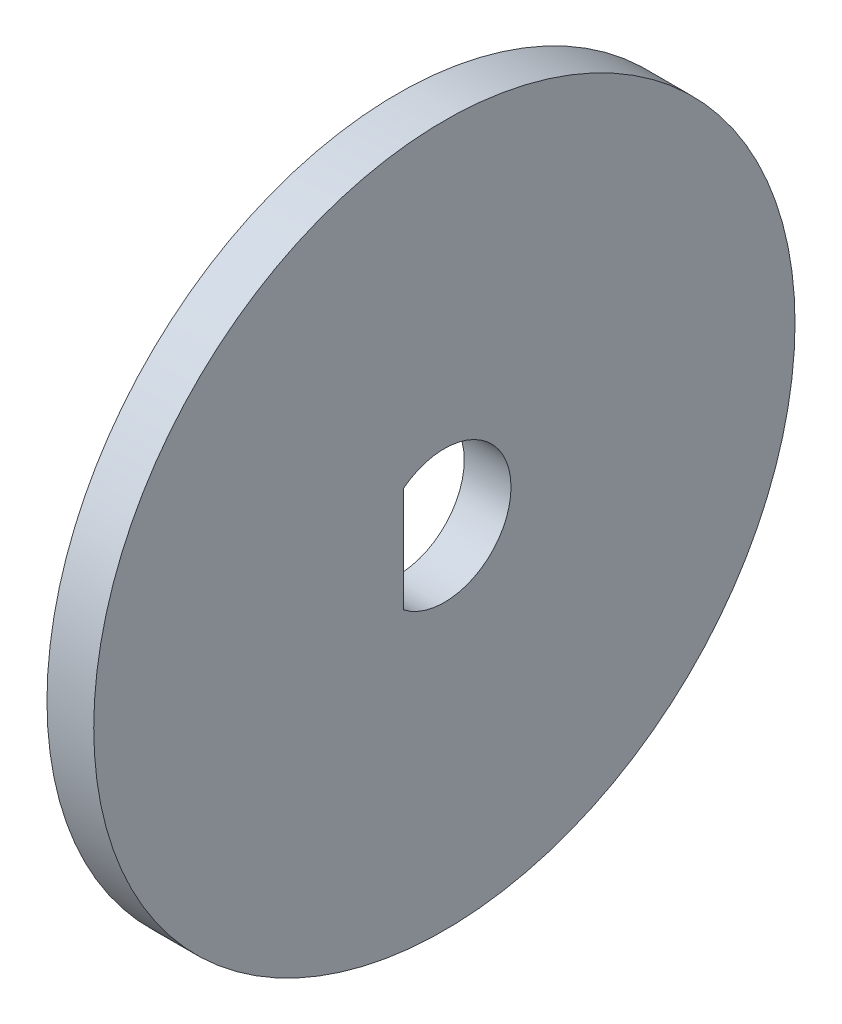
ISO-10303-21;
HEADER;
FILE_DESCRIPTION(('STEP AP214'),'2;1');
FILE_NAME('part.step','',(''),(''),'','','');
FILE_SCHEMA(('AUTOMOTIVE_DESIGN { 1 0 10303 214 1 1 1 1 }'));
ENDSEC;
DATA;
#1=APPLICATION_CONTEXT('core data for automotive mechanical design processes');
#2=APPLICATION_PROTOCOL_DEFINITION('international standard','automotive_design',2000,#1);
#3=PRODUCT_CONTEXT('',#1,'mechanical');
#4=PRODUCT('Part','Part','',(#3));
#5=PRODUCT_RELATED_PRODUCT_CATEGORY('part','',(#4));
#6=PRODUCT_DEFINITION_FORMATION('','',#4);
#7=PRODUCT_DEFINITION_CONTEXT('part definition',#1,'design');
#8=PRODUCT_DEFINITION('design','',#6,#7);
#9=PRODUCT_DEFINITION_SHAPE('','',#8);
#10=(LENGTH_UNIT() NAMED_UNIT(*) SI_UNIT(.MILLI.,.METRE.));
#11=(NAMED_UNIT(*) PLANE_ANGLE_UNIT() SI_UNIT($,.RADIAN.));
#12=(NAMED_UNIT(*) SI_UNIT($,.STERADIAN.) SOLID_ANGLE_UNIT());
#13=UNCERTAINTY_MEASURE_WITH_UNIT(LENGTH_MEASURE(1.E-05),#10,'distance_accuracy_value','');
#14=(GEOMETRIC_REPRESENTATION_CONTEXT(3) GLOBAL_UNCERTAINTY_ASSIGNED_CONTEXT((#13)) GLOBAL_UNIT_ASSIGNED_CONTEXT((#10,
#11,#12)) REPRESENTATION_CONTEXT('',''));
#15=CARTESIAN_POINT('',(0.,0.,0.));
#16=DIRECTION('',(0.,0.,1.));
#17=DIRECTION('',(1.,0.,0.));
#18=AXIS2_PLACEMENT_3D('',#15,#16,#17);
#19=CARTESIAN_POINT('',(2.,0.,0.));
#20=DIRECTION('',(-1.,0.,0.));
#21=DIRECTION('',(0.,0.,1.));
#22=AXIS2_PLACEMENT_3D('',#19,#20,#21);
#23=CYLINDRICAL_SURFACE('',#22,15.);
#24=CARTESIAN_POINT('',(2.,0.,0.));
#25=DIRECTION('',(1.,0.,0.));
#26=DIRECTION('',(0.,0.,-1.));
#27=AXIS2_PLACEMENT_3D('',#24,#25,#26);
#28=CIRCLE('',#27,15.);
#29=CARTESIAN_POINT('',(2.,0.,-15.));
#30=VERTEX_POINT('',#29);
#31=EDGE_CURVE('E11',#30,#30,#28,.T.);
#32=ORIENTED_EDGE('',*,*,#31,.F.);
#33=EDGE_LOOP('',(#32));
#34=FACE_BOUND('',#33,.T.);
#35=CARTESIAN_POINT('',(0.,0.,0.));
#36=DIRECTION('',(1.,0.,0.));
#37=DIRECTION('',(0.,0.,-1.));
#38=AXIS2_PLACEMENT_3D('',#35,#36,#37);
#39=CIRCLE('',#38,15.);
#40=CARTESIAN_POINT('',(0.,0.,-15.));
#41=VERTEX_POINT('',#40);
#42=EDGE_CURVE('E38',#41,#41,#39,.T.);
#43=ORIENTED_EDGE('',*,*,#42,.T.);
#44=EDGE_LOOP('',(#43));
#45=FACE_BOUND('',#44,.T.);
#46=ADVANCED_FACE('F35',(#34,#45),#23,.T.);
#47=CARTESIAN_POINT('',(2.,0.,0.));
#48=DIRECTION('',(1.,0.,0.));
#49=DIRECTION('',(0.,0.,-1.));
#50=AXIS2_PLACEMENT_3D('',#47,#48,#49);
#51=PLANE('',#50);
#52=CARTESIAN_POINT('',(2.,0.,0.));
#53=DIRECTION('',(1.,0.,0.));
#54=DIRECTION('',(0.,0.,-1.));
#55=AXIS2_PLACEMENT_3D('',#52,#53,#54);
#56=CIRCLE('',#55,2.85);
#57=CARTESIAN_POINT('',(2.,-2.25,1.74928556845359));
#58=VERTEX_POINT('',#57);
#59=CARTESIAN_POINT('',(2.,2.25,1.74928556845359));
#60=VERTEX_POINT('',#59);
#61=EDGE_CURVE('E49',#58,#60,#56,.T.);
#62=ORIENTED_EDGE('',*,*,#61,.F.);
#63=DIRECTION('',(0.,-1.,0.));
#64=VECTOR('',#63,1.);
#65=CARTESIAN_POINT('',(2.,2.25,1.74928556845359));
#66=LINE('',#65,#64);
#67=EDGE_CURVE('E68',#60,#58,#66,.T.);
#68=ORIENTED_EDGE('',*,*,#67,.F.);
#69=EDGE_LOOP('',(#62,#68));
#70=FACE_BOUND('',#69,.T.);
#71=ORIENTED_EDGE('',*,*,#31,.T.);
#72=EDGE_LOOP('',(#71));
#73=FACE_BOUND('',#72,.T.);
#74=ADVANCED_FACE('F72',(#70,#73),#51,.T.);
#75=CARTESIAN_POINT('',(0.,0.,0.));
#76=DIRECTION('',(1.,0.,0.));
#77=DIRECTION('',(0.,0.,-1.));
#78=AXIS2_PLACEMENT_3D('',#75,#76,#77);
#79=PLANE('',#78);
#80=DIRECTION('',(0.,-1.,0.));
#81=VECTOR('',#80,1.);
#82=CARTESIAN_POINT('',(0.,2.25,1.74928556845359));
#83=LINE('',#82,#81);
#84=CARTESIAN_POINT('',(0.,2.25,1.74928556845359));
#85=VERTEX_POINT('',#84);
#86=CARTESIAN_POINT('',(0.,-2.25,1.74928556845359));
#87=VERTEX_POINT('',#86);
#88=EDGE_CURVE('E76',#85,#87,#83,.T.);
#89=ORIENTED_EDGE('',*,*,#88,.T.);
#90=CARTESIAN_POINT('',(0.,0.,0.));
#91=DIRECTION('',(1.,0.,0.));
#92=DIRECTION('',(0.,0.,-1.));
#93=AXIS2_PLACEMENT_3D('',#90,#91,#92);
#94=CIRCLE('',#93,2.85);
#95=EDGE_CURVE('E54',#87,#85,#94,.T.);
#96=ORIENTED_EDGE('',*,*,#95,.T.);
#97=EDGE_LOOP('',(#89,#96));
#98=FACE_BOUND('',#97,.T.);
#99=ORIENTED_EDGE('',*,*,#42,.F.);
#100=EDGE_LOOP('',(#99));
#101=FACE_BOUND('',#100,.T.);
#102=ADVANCED_FACE('F80',(#98,#101),#79,.F.);
#103=CARTESIAN_POINT('',(0.,0.,0.));
#104=DIRECTION('',(1.,0.,0.));
#105=DIRECTION('',(0.,0.,-1.));
#106=AXIS2_PLACEMENT_3D('',#103,#104,#105);
#107=CYLINDRICAL_SURFACE('',#106,2.85);
#108=ORIENTED_EDGE('',*,*,#61,.T.);
#109=DIRECTION('',(1.,0.,0.));
#110=VECTOR('',#109,1.);
#111=CARTESIAN_POINT('',(0.,2.25,1.74928556845359));
#112=LINE('',#111,#110);
#113=EDGE_CURVE('E65',#85,#60,#112,.T.);
#114=ORIENTED_EDGE('',*,*,#113,.F.);
#115=ORIENTED_EDGE('',*,*,#95,.F.);
#116=DIRECTION('',(1.,0.,0.));
#117=VECTOR('',#116,1.);
#118=CARTESIAN_POINT('',(0.,-2.25,1.74928556845359));
#119=LINE('',#118,#117);
#120=EDGE_CURVE('E59',#87,#58,#119,.T.);
#121=ORIENTED_EDGE('',*,*,#120,.T.);
#122=EDGE_LOOP('',(#108,#114,#115,#121));
#123=FACE_BOUND('',#122,.T.);
#124=ADVANCED_FACE('F61',(#123),#107,.F.);
#125=CARTESIAN_POINT('',(0.,2.25,1.74928556845359));
#126=DIRECTION('',(0.,0.,1.));
#127=DIRECTION('',(1.,0.,0.));
#128=AXIS2_PLACEMENT_3D('',#125,#126,#127);
#129=PLANE('',#128);
#130=ORIENTED_EDGE('',*,*,#67,.T.);
#131=ORIENTED_EDGE('',*,*,#120,.F.);
#132=ORIENTED_EDGE('',*,*,#88,.F.);
#133=ORIENTED_EDGE('',*,*,#113,.T.);
#134=EDGE_LOOP('',(#130,#131,#132,#133));
#135=FACE_BOUND('',#134,.T.);
#136=ADVANCED_FACE('F69',(#135),#129,.F.);
#137=CLOSED_SHELL('',(#46,#74,#102,#124,#136));
#138=MANIFOLD_SOLID_BREP('B2',#137);
#139=ADVANCED_BREP_SHAPE_REPRESENTATION('',(#18,#138),#14);
#140=SHAPE_DEFINITION_REPRESENTATION(#9,#139);
ENDSEC;
END-ISO-10303-21;
